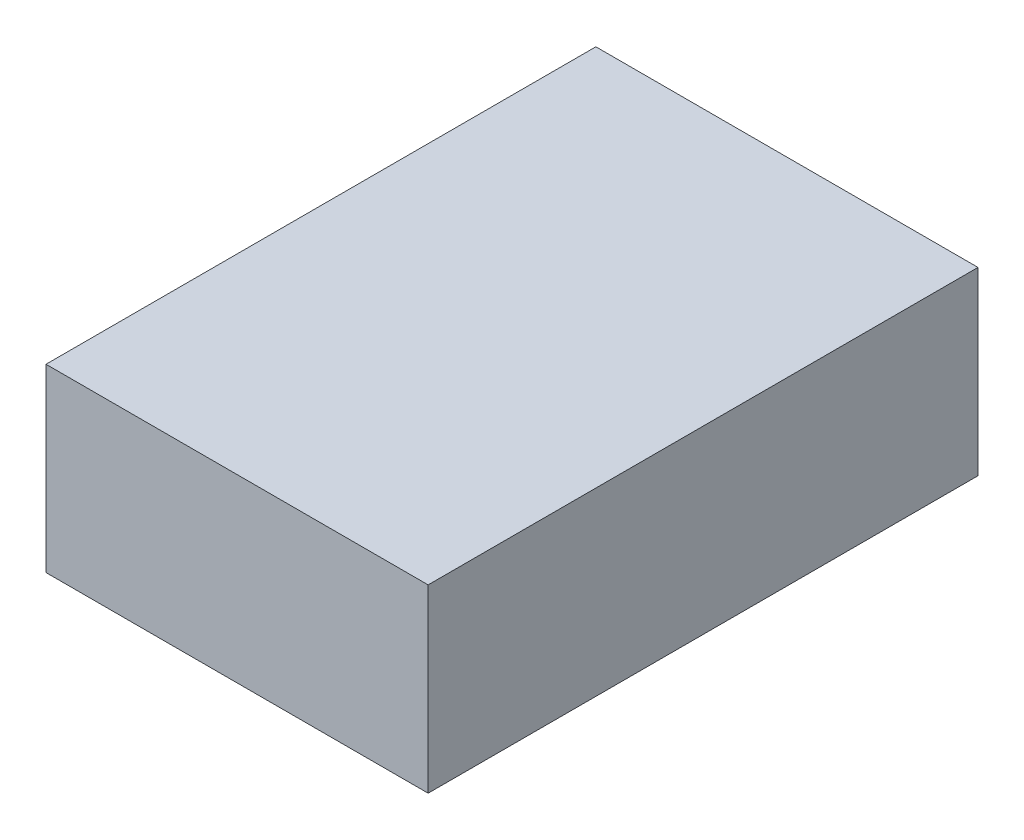
ISO-10303-21;
HEADER;
FILE_DESCRIPTION(('STEP AP214'),'2;1');
FILE_NAME('part.step','',(''),(''),'','','');
FILE_SCHEMA(('AUTOMOTIVE_DESIGN { 1 0 10303 214 1 1 1 1 }'));
ENDSEC;
DATA;
#1=APPLICATION_CONTEXT('core data for automotive mechanical design processes');
#2=APPLICATION_PROTOCOL_DEFINITION('international standard','automotive_design',2000,#1);
#3=PRODUCT_CONTEXT('',#1,'mechanical');
#4=PRODUCT('Part','Part','',(#3));
#5=PRODUCT_RELATED_PRODUCT_CATEGORY('part','',(#4));
#6=PRODUCT_DEFINITION_FORMATION('','',#4);
#7=PRODUCT_DEFINITION_CONTEXT('part definition',#1,'design');
#8=PRODUCT_DEFINITION('design','',#6,#7);
#9=PRODUCT_DEFINITION_SHAPE('','',#8);
#10=(LENGTH_UNIT() NAMED_UNIT(*) SI_UNIT(.MILLI.,.METRE.));
#11=(NAMED_UNIT(*) PLANE_ANGLE_UNIT() SI_UNIT($,.RADIAN.));
#12=(NAMED_UNIT(*) SI_UNIT($,.STERADIAN.) SOLID_ANGLE_UNIT());
#13=UNCERTAINTY_MEASURE_WITH_UNIT(LENGTH_MEASURE(1.E-05),#10,'distance_accuracy_value','');
#14=(GEOMETRIC_REPRESENTATION_CONTEXT(3) GLOBAL_UNCERTAINTY_ASSIGNED_CONTEXT((#13)) GLOBAL_UNIT_ASSIGNED_CONTEXT((#10,
#11,#12)) REPRESENTATION_CONTEXT('',''));
#15=CARTESIAN_POINT('',(0.,0.,0.));
#16=DIRECTION('',(0.,0.,1.));
#17=DIRECTION('',(1.,0.,0.));
#18=AXIS2_PLACEMENT_3D('',#15,#16,#17);
#19=CARTESIAN_POINT('',(-35.7347109243236,199.418809654844,-5.));
#20=DIRECTION('',(-1.,0.,0.));
#21=DIRECTION('',(0.,-1.,0.));
#22=AXIS2_PLACEMENT_3D('',#19,#20,#21);
#23=PLANE('',#22);
#24=DIRECTION('',(0.,0.,1.));
#25=VECTOR('',#24,1.);
#26=CARTESIAN_POINT('',(-35.7347109243236,151.624033580219,-5.));
#27=LINE('',#26,#25);
#28=CARTESIAN_POINT('',(-35.7347109243236,151.624033580219,-5.));
#29=VERTEX_POINT('',#28);
#30=CARTESIAN_POINT('',(-35.7347109243236,151.624033580219,140.649714647687));
#31=VERTEX_POINT('',#30);
#32=EDGE_CURVE('E38',#29,#31,#27,.T.);
#33=ORIENTED_EDGE('',*,*,#32,.T.);
#34=DIRECTION('',(0.,-1.,0.));
#35=VECTOR('',#34,1.);
#36=CARTESIAN_POINT('',(-35.7347109243236,199.418809654844,140.649714647687));
#37=LINE('',#36,#35);
#38=CARTESIAN_POINT('',(-35.7347109243236,199.418809654844,140.649714647687));
#39=VERTEX_POINT('',#38);
#40=EDGE_CURVE('E75',#39,#31,#37,.T.);
#41=ORIENTED_EDGE('',*,*,#40,.F.);
#42=DIRECTION('',(0.,0.,1.));
#43=VECTOR('',#42,1.);
#44=CARTESIAN_POINT('',(-35.7347109243236,199.418809654844,-5.));
#45=LINE('',#44,#43);
#46=CARTESIAN_POINT('',(-35.7347109243236,199.418809654844,-5.));
#47=VERTEX_POINT('',#46);
#48=EDGE_CURVE('E11',#47,#39,#45,.T.);
#49=ORIENTED_EDGE('',*,*,#48,.F.);
#50=DIRECTION('',(0.,-1.,0.));
#51=VECTOR('',#50,1.);
#52=CARTESIAN_POINT('',(-35.7347109243236,199.418809654844,-5.));
#53=LINE('',#52,#51);
#54=EDGE_CURVE('E76',#47,#29,#53,.T.);
#55=ORIENTED_EDGE('',*,*,#54,.T.);
#56=EDGE_LOOP('',(#33,#41,#49,#55));
#57=FACE_BOUND('',#56,.T.);
#58=ADVANCED_FACE('F35',(#57),#23,.T.);
#59=CARTESIAN_POINT('',(-35.7347109243236,199.418809654844,-5.));
#60=DIRECTION('',(0.,1.,0.));
#61=DIRECTION('',(0.,0.,1.));
#62=AXIS2_PLACEMENT_3D('',#59,#60,#61);
#63=PLANE('',#62);
#64=ORIENTED_EDGE('',*,*,#48,.T.);
#65=DIRECTION('',(-1.,0.,0.));
#66=VECTOR('',#65,1.);
#67=CARTESIAN_POINT('',(-35.7347109243236,199.418809654844,140.649714647687));
#68=LINE('',#67,#66);
#69=CARTESIAN_POINT('',(65.4879132856081,199.418809654844,140.649714647687));
#70=VERTEX_POINT('',#69);
#71=EDGE_CURVE('E92',#70,#39,#68,.T.);
#72=ORIENTED_EDGE('',*,*,#71,.F.);
#73=DIRECTION('',(0.,0.,1.));
#74=VECTOR('',#73,1.);
#75=CARTESIAN_POINT('',(65.4879132856081,199.418809654844,-5.));
#76=LINE('',#75,#74);
#77=CARTESIAN_POINT('',(65.4879132856081,199.418809654844,-5.));
#78=VERTEX_POINT('',#77);
#79=EDGE_CURVE('E43',#78,#70,#76,.T.);
#80=ORIENTED_EDGE('',*,*,#79,.F.);
#81=DIRECTION('',(-1.,0.,0.));
#82=VECTOR('',#81,1.);
#83=CARTESIAN_POINT('',(-35.7347109243236,199.418809654844,-5.));
#84=LINE('',#83,#82);
#85=EDGE_CURVE('E81',#78,#47,#84,.T.);
#86=ORIENTED_EDGE('',*,*,#85,.T.);
#87=EDGE_LOOP('',(#64,#72,#80,#86));
#88=FACE_BOUND('',#87,.T.);
#89=ADVANCED_FACE('F107',(#88),#63,.T.);
#90=CARTESIAN_POINT('',(65.4879132856081,199.418809654844,-5.));
#91=DIRECTION('',(1.,0.,0.));
#92=DIRECTION('',(0.,0.,-1.));
#93=AXIS2_PLACEMENT_3D('',#90,#91,#92);
#94=PLANE('',#93);
#95=ORIENTED_EDGE('',*,*,#79,.T.);
#96=DIRECTION('',(0.,1.,0.));
#97=VECTOR('',#96,1.);
#98=CARTESIAN_POINT('',(65.4879132856081,199.418809654844,140.649714647687));
#99=LINE('',#98,#97);
#100=CARTESIAN_POINT('',(65.4879132856081,151.624033580219,140.649714647687));
#101=VERTEX_POINT('',#100);
#102=EDGE_CURVE('E88',#101,#70,#99,.T.);
#103=ORIENTED_EDGE('',*,*,#102,.F.);
#104=DIRECTION('',(0.,0.,1.));
#105=VECTOR('',#104,1.);
#106=CARTESIAN_POINT('',(65.4879132856081,151.624033580219,-5.));
#107=LINE('',#106,#105);
#108=CARTESIAN_POINT('',(65.4879132856081,151.624033580219,-5.));
#109=VERTEX_POINT('',#108);
#110=EDGE_CURVE('E80',#109,#101,#107,.T.);
#111=ORIENTED_EDGE('',*,*,#110,.F.);
#112=DIRECTION('',(0.,1.,0.));
#113=VECTOR('',#112,1.);
#114=CARTESIAN_POINT('',(65.4879132856081,199.418809654844,-5.));
#115=LINE('',#114,#113);
#116=EDGE_CURVE('E100',#109,#78,#115,.T.);
#117=ORIENTED_EDGE('',*,*,#116,.T.);
#118=EDGE_LOOP('',(#95,#103,#111,#117));
#119=FACE_BOUND('',#118,.T.);
#120=ADVANCED_FACE('F104',(#119),#94,.T.);
#121=CARTESIAN_POINT('',(-35.7347109243236,151.624033580219,-5.));
#122=DIRECTION('',(0.,-1.,0.));
#123=DIRECTION('',(0.,0.,-1.));
#124=AXIS2_PLACEMENT_3D('',#121,#122,#123);
#125=PLANE('',#124);
#126=ORIENTED_EDGE('',*,*,#110,.T.);
#127=DIRECTION('',(1.,0.,0.));
#128=VECTOR('',#127,1.);
#129=CARTESIAN_POINT('',(-35.7347109243236,151.624033580219,140.649714647687));
#130=LINE('',#129,#128);
#131=EDGE_CURVE('E83',#31,#101,#130,.T.);
#132=ORIENTED_EDGE('',*,*,#131,.F.);
#133=ORIENTED_EDGE('',*,*,#32,.F.);
#134=DIRECTION('',(1.,0.,0.));
#135=VECTOR('',#134,1.);
#136=CARTESIAN_POINT('',(-35.7347109243236,151.624033580219,-5.));
#137=LINE('',#136,#135);
#138=EDGE_CURVE('E98',#29,#109,#137,.T.);
#139=ORIENTED_EDGE('',*,*,#138,.T.);
#140=EDGE_LOOP('',(#126,#132,#133,#139));
#141=FACE_BOUND('',#140,.T.);
#142=ADVANCED_FACE('F84',(#141),#125,.T.);
#143=CARTESIAN_POINT('',(0.,0.,-5.));
#144=DIRECTION('',(0.,0.,1.));
#145=DIRECTION('',(1.,0.,0.));
#146=AXIS2_PLACEMENT_3D('',#143,#144,#145);
#147=PLANE('',#146);
#148=ORIENTED_EDGE('',*,*,#54,.F.);
#149=ORIENTED_EDGE('',*,*,#85,.F.);
#150=ORIENTED_EDGE('',*,*,#116,.F.);
#151=ORIENTED_EDGE('',*,*,#138,.F.);
#152=EDGE_LOOP('',(#148,#149,#150,#151));
#153=FACE_BOUND('',#152,.T.);
#154=ADVANCED_FACE('F109',(#153),#147,.F.);
#155=CARTESIAN_POINT('',(0.,0.,140.649714647687));
#156=DIRECTION('',(0.,0.,1.));
#157=DIRECTION('',(1.,0.,0.));
#158=AXIS2_PLACEMENT_3D('',#155,#156,#157);
#159=PLANE('',#158);
#160=ORIENTED_EDGE('',*,*,#40,.T.);
#161=ORIENTED_EDGE('',*,*,#131,.T.);
#162=ORIENTED_EDGE('',*,*,#102,.T.);
#163=ORIENTED_EDGE('',*,*,#71,.T.);
#164=EDGE_LOOP('',(#160,#161,#162,#163));
#165=FACE_BOUND('',#164,.T.);
#166=ADVANCED_FACE('F91',(#165),#159,.T.);
#167=CLOSED_SHELL('',(#58,#89,#120,#142,#154,#166));
#168=MANIFOLD_SOLID_BREP('B2',#167);
#169=ADVANCED_BREP_SHAPE_REPRESENTATION('',(#18,#168),#14);
#170=SHAPE_DEFINITION_REPRESENTATION(#9,#169);
ENDSEC;
END-ISO-10303-21;
